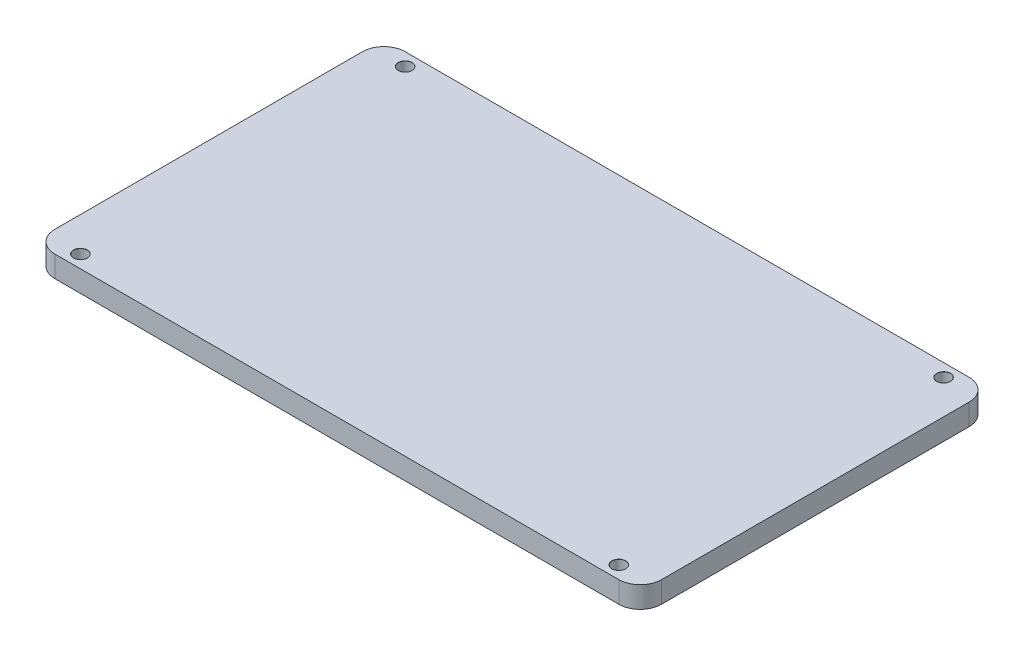
ISO-10303-21;
HEADER;
FILE_DESCRIPTION(('STEP AP214'),'2;1');
FILE_NAME('part.step','',(''),(''),'','','');
FILE_SCHEMA(('AUTOMOTIVE_DESIGN { 1 0 10303 214 1 1 1 1 }'));
ENDSEC;
DATA;
#1=APPLICATION_CONTEXT('core data for automotive mechanical design processes');
#2=APPLICATION_PROTOCOL_DEFINITION('international standard','automotive_design',2000,#1);
#3=PRODUCT_CONTEXT('',#1,'mechanical');
#4=PRODUCT('Part','Part','',(#3));
#5=PRODUCT_RELATED_PRODUCT_CATEGORY('part','',(#4));
#6=PRODUCT_DEFINITION_FORMATION('','',#4);
#7=PRODUCT_DEFINITION_CONTEXT('part definition',#1,'design');
#8=PRODUCT_DEFINITION('design','',#6,#7);
#9=PRODUCT_DEFINITION_SHAPE('','',#8);
#10=(LENGTH_UNIT() NAMED_UNIT(*) SI_UNIT(.MILLI.,.METRE.));
#11=(NAMED_UNIT(*) PLANE_ANGLE_UNIT() SI_UNIT($,.RADIAN.));
#12=(NAMED_UNIT(*) SI_UNIT($,.STERADIAN.) SOLID_ANGLE_UNIT());
#13=UNCERTAINTY_MEASURE_WITH_UNIT(LENGTH_MEASURE(1.E-05),#10,'distance_accuracy_value','');
#14=(GEOMETRIC_REPRESENTATION_CONTEXT(3) GLOBAL_UNCERTAINTY_ASSIGNED_CONTEXT((#13)) GLOBAL_UNIT_ASSIGNED_CONTEXT((#10,
#11,#12)) REPRESENTATION_CONTEXT('',''));
#15=CARTESIAN_POINT('',(0.,0.,0.));
#16=DIRECTION('',(0.,0.,1.));
#17=DIRECTION('',(1.,0.,0.));
#18=AXIS2_PLACEMENT_3D('',#15,#16,#17);
#19=CARTESIAN_POINT('',(71.,5.,41.));
#20=DIRECTION('',(-1.,0.,0.));
#21=DIRECTION('',(0.,0.,1.));
#22=AXIS2_PLACEMENT_3D('',#19,#20,#21);
#23=PLANE('',#22);
#24=DIRECTION('',(0.,0.,-1.));
#25=VECTOR('',#24,1.);
#26=CARTESIAN_POINT('',(71.,0.,41.));
#27=LINE('',#26,#25);
#28=CARTESIAN_POINT('',(71.,0.,36.));
#29=VERTEX_POINT('',#28);
#30=CARTESIAN_POINT('',(71.,0.,-36.));
#31=VERTEX_POINT('',#30);
#32=EDGE_CURVE('E136',#29,#31,#27,.T.);
#33=ORIENTED_EDGE('',*,*,#32,.T.);
#34=DIRECTION('',(0.,-1.,0.));
#35=VECTOR('',#34,1.);
#36=CARTESIAN_POINT('',(71.,5.,-36.));
#37=LINE('',#36,#35);
#38=CARTESIAN_POINT('',(71.,5.,-36.));
#39=VERTEX_POINT('',#38);
#40=EDGE_CURVE('E111',#31,#39,#37,.F.);
#41=ORIENTED_EDGE('',*,*,#40,.T.);
#42=DIRECTION('',(0.,0.,-1.));
#43=VECTOR('',#42,1.);
#44=CARTESIAN_POINT('',(71.,5.,41.));
#45=LINE('',#44,#43);
#46=CARTESIAN_POINT('',(71.,5.,36.));
#47=VERTEX_POINT('',#46);
#48=EDGE_CURVE('E149',#47,#39,#45,.T.);
#49=ORIENTED_EDGE('',*,*,#48,.F.);
#50=DIRECTION('',(0.,-1.,0.));
#51=VECTOR('',#50,1.);
#52=CARTESIAN_POINT('',(71.,5.,36.));
#53=LINE('',#52,#51);
#54=EDGE_CURVE('E117',#47,#29,#53,.T.);
#55=ORIENTED_EDGE('',*,*,#54,.T.);
#56=EDGE_LOOP('',(#33,#41,#49,#55));
#57=FACE_BOUND('',#56,.T.);
#58=ADVANCED_FACE('F39',(#57),#23,.F.);
#59=CARTESIAN_POINT('',(-71.,5.,-41.));
#60=DIRECTION('',(0.,0.,1.));
#61=DIRECTION('',(1.,0.,0.));
#62=AXIS2_PLACEMENT_3D('',#59,#60,#61);
#63=PLANE('',#62);
#64=DIRECTION('',(-1.,0.,0.));
#65=VECTOR('',#64,1.);
#66=CARTESIAN_POINT('',(-71.,5.,-41.));
#67=LINE('',#66,#65);
#68=CARTESIAN_POINT('',(66.,5.,-41.));
#69=VERTEX_POINT('',#68);
#70=CARTESIAN_POINT('',(-66.,5.,-41.));
#71=VERTEX_POINT('',#70);
#72=EDGE_CURVE('E127',#69,#71,#67,.T.);
#73=ORIENTED_EDGE('',*,*,#72,.F.);
#74=DIRECTION('',(0.,-1.,0.));
#75=VECTOR('',#74,1.);
#76=CARTESIAN_POINT('',(66.,5.,-41.));
#77=LINE('',#76,#75);
#78=CARTESIAN_POINT('',(66.,0.,-41.));
#79=VERTEX_POINT('',#78);
#80=EDGE_CURVE('E110',#69,#79,#77,.T.);
#81=ORIENTED_EDGE('',*,*,#80,.T.);
#82=DIRECTION('',(-1.,0.,0.));
#83=VECTOR('',#82,1.);
#84=CARTESIAN_POINT('',(-71.,0.,-41.));
#85=LINE('',#84,#83);
#86=CARTESIAN_POINT('',(-66.,0.,-41.));
#87=VERTEX_POINT('',#86);
#88=EDGE_CURVE('E124',#79,#87,#85,.T.);
#89=ORIENTED_EDGE('',*,*,#88,.T.);
#90=DIRECTION('',(0.,-1.,0.));
#91=VECTOR('',#90,1.);
#92=CARTESIAN_POINT('',(-66.,5.,-41.));
#93=LINE('',#92,#91);
#94=EDGE_CURVE('E130',#87,#71,#93,.F.);
#95=ORIENTED_EDGE('',*,*,#94,.T.);
#96=EDGE_LOOP('',(#73,#81,#89,#95));
#97=FACE_BOUND('',#96,.T.);
#98=ADVANCED_FACE('F123',(#97),#63,.F.);
#99=CARTESIAN_POINT('',(-71.,5.,41.));
#100=DIRECTION('',(1.,0.,0.));
#101=DIRECTION('',(0.,0.,-1.));
#102=AXIS2_PLACEMENT_3D('',#99,#100,#101);
#103=PLANE('',#102);
#104=DIRECTION('',(0.,0.,1.));
#105=VECTOR('',#104,1.);
#106=CARTESIAN_POINT('',(-71.,0.,41.));
#107=LINE('',#106,#105);
#108=CARTESIAN_POINT('',(-71.,0.,-36.));
#109=VERTEX_POINT('',#108);
#110=CARTESIAN_POINT('',(-71.,0.,36.));
#111=VERTEX_POINT('',#110);
#112=EDGE_CURVE('E135',#109,#111,#107,.T.);
#113=ORIENTED_EDGE('',*,*,#112,.T.);
#114=DIRECTION('',(0.,-1.,0.));
#115=VECTOR('',#114,1.);
#116=CARTESIAN_POINT('',(-71.,5.,36.));
#117=LINE('',#116,#115);
#118=CARTESIAN_POINT('',(-71.,5.,36.));
#119=VERTEX_POINT('',#118);
#120=EDGE_CURVE('E11',#111,#119,#117,.F.);
#121=ORIENTED_EDGE('',*,*,#120,.T.);
#122=DIRECTION('',(0.,0.,1.));
#123=VECTOR('',#122,1.);
#124=CARTESIAN_POINT('',(-71.,5.,41.));
#125=LINE('',#124,#123);
#126=CARTESIAN_POINT('',(-71.,5.,-36.));
#127=VERTEX_POINT('',#126);
#128=EDGE_CURVE('E188',#127,#119,#125,.T.);
#129=ORIENTED_EDGE('',*,*,#128,.F.);
#130=DIRECTION('',(0.,-1.,0.));
#131=VECTOR('',#130,1.);
#132=CARTESIAN_POINT('',(-71.,5.,-36.));
#133=LINE('',#132,#131);
#134=EDGE_CURVE('E48',#127,#109,#133,.T.);
#135=ORIENTED_EDGE('',*,*,#134,.T.);
#136=EDGE_LOOP('',(#113,#121,#129,#135));
#137=FACE_BOUND('',#136,.T.);
#138=ADVANCED_FACE('F186',(#137),#103,.F.);
#139=CARTESIAN_POINT('',(-71.,5.,41.));
#140=DIRECTION('',(0.,0.,-1.));
#141=DIRECTION('',(-1.,0.,0.));
#142=AXIS2_PLACEMENT_3D('',#139,#140,#141);
#143=PLANE('',#142);
#144=DIRECTION('',(1.,0.,0.));
#145=VECTOR('',#144,1.);
#146=CARTESIAN_POINT('',(-71.,0.,41.));
#147=LINE('',#146,#145);
#148=CARTESIAN_POINT('',(-66.,0.,41.));
#149=VERTEX_POINT('',#148);
#150=CARTESIAN_POINT('',(66.,0.,41.));
#151=VERTEX_POINT('',#150);
#152=EDGE_CURVE('E141',#149,#151,#147,.T.);
#153=ORIENTED_EDGE('',*,*,#152,.T.);
#154=DIRECTION('',(0.,-1.,0.));
#155=VECTOR('',#154,1.);
#156=CARTESIAN_POINT('',(66.,5.,41.));
#157=LINE('',#156,#155);
#158=CARTESIAN_POINT('',(66.,5.,41.));
#159=VERTEX_POINT('',#158);
#160=EDGE_CURVE('E55',#151,#159,#157,.F.);
#161=ORIENTED_EDGE('',*,*,#160,.T.);
#162=DIRECTION('',(1.,0.,0.));
#163=VECTOR('',#162,1.);
#164=CARTESIAN_POINT('',(-71.,5.,41.));
#165=LINE('',#164,#163);
#166=CARTESIAN_POINT('',(-66.,5.,41.));
#167=VERTEX_POINT('',#166);
#168=EDGE_CURVE('E151',#167,#159,#165,.T.);
#169=ORIENTED_EDGE('',*,*,#168,.F.);
#170=DIRECTION('',(0.,-1.,0.));
#171=VECTOR('',#170,1.);
#172=CARTESIAN_POINT('',(-66.,5.,41.));
#173=LINE('',#172,#171);
#174=EDGE_CURVE('E176',#167,#149,#173,.T.);
#175=ORIENTED_EDGE('',*,*,#174,.T.);
#176=EDGE_LOOP('',(#153,#161,#169,#175));
#177=FACE_BOUND('',#176,.T.);
#178=ADVANCED_FACE('F195',(#177),#143,.F.);
#179=CARTESIAN_POINT('',(0.,5.,0.));
#180=DIRECTION('',(0.,-1.,0.));
#181=DIRECTION('',(0.,0.,-1.));
#182=AXIS2_PLACEMENT_3D('',#179,#180,#181);
#183=PLANE('',#182);
#184=CARTESIAN_POINT('',(-63.,5.,-38.));
#185=DIRECTION('',(0.,1.,0.));
#186=DIRECTION('',(0.,0.,1.));
#187=AXIS2_PLACEMENT_3D('',#184,#185,#186);
#188=CIRCLE('',#187,1.625);
#189=CARTESIAN_POINT('',(-63.,5.,-36.375));
#190=VERTEX_POINT('',#189);
#191=EDGE_CURVE('E249',#190,#190,#188,.T.);
#192=ORIENTED_EDGE('',*,*,#191,.F.);
#193=EDGE_LOOP('',(#192));
#194=FACE_BOUND('',#193,.T.);
#195=CARTESIAN_POINT('',(-63.,5.,38.));
#196=DIRECTION('',(0.,1.,0.));
#197=DIRECTION('',(0.,0.,1.));
#198=AXIS2_PLACEMENT_3D('',#195,#196,#197);
#199=CIRCLE('',#198,1.625);
#200=CARTESIAN_POINT('',(-63.,5.,39.625));
#201=VERTEX_POINT('',#200);
#202=EDGE_CURVE('E237',#201,#201,#199,.T.);
#203=ORIENTED_EDGE('',*,*,#202,.F.);
#204=EDGE_LOOP('',(#203));
#205=FACE_BOUND('',#204,.T.);
#206=CARTESIAN_POINT('',(63.,5.,-38.));
#207=DIRECTION('',(0.,1.,0.));
#208=DIRECTION('',(0.,0.,1.));
#209=AXIS2_PLACEMENT_3D('',#206,#207,#208);
#210=CIRCLE('',#209,1.625);
#211=CARTESIAN_POINT('',(63.,5.,-36.375));
#212=VERTEX_POINT('',#211);
#213=EDGE_CURVE('E225',#212,#212,#210,.T.);
#214=ORIENTED_EDGE('',*,*,#213,.F.);
#215=EDGE_LOOP('',(#214));
#216=FACE_BOUND('',#215,.T.);
#217=CARTESIAN_POINT('',(63.,5.,38.));
#218=DIRECTION('',(0.,1.,0.));
#219=DIRECTION('',(0.,0.,1.));
#220=AXIS2_PLACEMENT_3D('',#217,#218,#219);
#221=CIRCLE('',#220,1.625);
#222=CARTESIAN_POINT('',(63.,5.,39.625));
#223=VERTEX_POINT('',#222);
#224=EDGE_CURVE('E213',#223,#223,#221,.T.);
#225=ORIENTED_EDGE('',*,*,#224,.F.);
#226=EDGE_LOOP('',(#225));
#227=FACE_BOUND('',#226,.T.);
#228=ORIENTED_EDGE('',*,*,#48,.T.);
#229=CARTESIAN_POINT('',(66.,5.,-36.));
#230=DIRECTION('',(0.,-1.,0.));
#231=DIRECTION('',(0.,0.,-1.));
#232=AXIS2_PLACEMENT_3D('',#229,#230,#231);
#233=CIRCLE('',#232,5.);
#234=EDGE_CURVE('E173',#39,#69,#233,.F.);
#235=ORIENTED_EDGE('',*,*,#234,.T.);
#236=ORIENTED_EDGE('',*,*,#72,.T.);
#237=CARTESIAN_POINT('',(-66.,5.,-36.));
#238=DIRECTION('',(0.,-1.,0.));
#239=DIRECTION('',(0.,0.,-1.));
#240=AXIS2_PLACEMENT_3D('',#237,#238,#239);
#241=CIRCLE('',#240,5.);
#242=EDGE_CURVE('E165',#71,#127,#241,.F.);
#243=ORIENTED_EDGE('',*,*,#242,.T.);
#244=ORIENTED_EDGE('',*,*,#128,.T.);
#245=CARTESIAN_POINT('',(-66.,5.,36.));
#246=DIRECTION('',(0.,-1.,0.));
#247=DIRECTION('',(0.,0.,-1.));
#248=AXIS2_PLACEMENT_3D('',#245,#246,#247);
#249=CIRCLE('',#248,5.);
#250=EDGE_CURVE('E62',#119,#167,#249,.F.);
#251=ORIENTED_EDGE('',*,*,#250,.T.);
#252=ORIENTED_EDGE('',*,*,#168,.T.);
#253=CARTESIAN_POINT('',(66.,5.,36.));
#254=DIRECTION('',(0.,-1.,0.));
#255=DIRECTION('',(0.,0.,-1.));
#256=AXIS2_PLACEMENT_3D('',#253,#254,#255);
#257=CIRCLE('',#256,5.);
#258=EDGE_CURVE('E170',#159,#47,#257,.F.);
#259=ORIENTED_EDGE('',*,*,#258,.T.);
#260=EDGE_LOOP('',(#228,#235,#236,#243,#244,#251,#252,#259));
#261=FACE_BOUND('',#260,.T.);
#262=ADVANCED_FACE('F256',(#194,#205,#216,#227,#261),#183,.F.);
#263=CARTESIAN_POINT('',(0.,0.,0.));
#264=DIRECTION('',(0.,-1.,0.));
#265=DIRECTION('',(0.,0.,-1.));
#266=AXIS2_PLACEMENT_3D('',#263,#264,#265);
#267=PLANE('',#266);
#268=CARTESIAN_POINT('',(-63.,0.,-38.));
#269=DIRECTION('',(0.,1.,0.));
#270=DIRECTION('',(0.,0.,1.));
#271=AXIS2_PLACEMENT_3D('',#268,#269,#270);
#272=CIRCLE('',#271,1.6);
#273=CARTESIAN_POINT('',(-63.,0.,-36.4));
#274=VERTEX_POINT('',#273);
#275=EDGE_CURVE('E241',#274,#274,#272,.T.);
#276=ORIENTED_EDGE('',*,*,#275,.T.);
#277=EDGE_LOOP('',(#276));
#278=FACE_BOUND('',#277,.T.);
#279=CARTESIAN_POINT('',(-63.,0.,38.));
#280=DIRECTION('',(0.,1.,0.));
#281=DIRECTION('',(0.,0.,1.));
#282=AXIS2_PLACEMENT_3D('',#279,#280,#281);
#283=CIRCLE('',#282,1.6);
#284=CARTESIAN_POINT('',(-63.,0.,39.6));
#285=VERTEX_POINT('',#284);
#286=EDGE_CURVE('E229',#285,#285,#283,.T.);
#287=ORIENTED_EDGE('',*,*,#286,.T.);
#288=EDGE_LOOP('',(#287));
#289=FACE_BOUND('',#288,.T.);
#290=CARTESIAN_POINT('',(63.,0.,-38.));
#291=DIRECTION('',(0.,1.,0.));
#292=DIRECTION('',(0.,0.,1.));
#293=AXIS2_PLACEMENT_3D('',#290,#291,#292);
#294=CIRCLE('',#293,1.6);
#295=CARTESIAN_POINT('',(63.,0.,-36.4));
#296=VERTEX_POINT('',#295);
#297=EDGE_CURVE('E217',#296,#296,#294,.T.);
#298=ORIENTED_EDGE('',*,*,#297,.T.);
#299=EDGE_LOOP('',(#298));
#300=FACE_BOUND('',#299,.T.);
#301=CARTESIAN_POINT('',(63.,0.,38.));
#302=DIRECTION('',(0.,1.,0.));
#303=DIRECTION('',(0.,0.,1.));
#304=AXIS2_PLACEMENT_3D('',#301,#302,#303);
#305=CIRCLE('',#304,1.6);
#306=CARTESIAN_POINT('',(63.,0.,39.6));
#307=VERTEX_POINT('',#306);
#308=EDGE_CURVE('E143',#307,#307,#305,.T.);
#309=ORIENTED_EDGE('',*,*,#308,.T.);
#310=EDGE_LOOP('',(#309));
#311=FACE_BOUND('',#310,.T.);
#312=ORIENTED_EDGE('',*,*,#88,.F.);
#313=CARTESIAN_POINT('',(66.,0.,-36.));
#314=DIRECTION('',(0.,-1.,0.));
#315=DIRECTION('',(0.,0.,-1.));
#316=AXIS2_PLACEMENT_3D('',#313,#314,#315);
#317=CIRCLE('',#316,5.);
#318=EDGE_CURVE('E106',#79,#31,#317,.T.);
#319=ORIENTED_EDGE('',*,*,#318,.T.);
#320=ORIENTED_EDGE('',*,*,#32,.F.);
#321=CARTESIAN_POINT('',(66.,0.,36.));
#322=DIRECTION('',(0.,-1.,0.));
#323=DIRECTION('',(0.,0.,-1.));
#324=AXIS2_PLACEMENT_3D('',#321,#322,#323);
#325=CIRCLE('',#324,5.);
#326=EDGE_CURVE('E118',#29,#151,#325,.T.);
#327=ORIENTED_EDGE('',*,*,#326,.T.);
#328=ORIENTED_EDGE('',*,*,#152,.F.);
#329=CARTESIAN_POINT('',(-66.,0.,36.));
#330=DIRECTION('',(0.,-1.,0.));
#331=DIRECTION('',(0.,0.,-1.));
#332=AXIS2_PLACEMENT_3D('',#329,#330,#331);
#333=CIRCLE('',#332,5.);
#334=EDGE_CURVE('E155',#149,#111,#333,.T.);
#335=ORIENTED_EDGE('',*,*,#334,.T.);
#336=ORIENTED_EDGE('',*,*,#112,.F.);
#337=CARTESIAN_POINT('',(-66.,0.,-36.));
#338=DIRECTION('',(0.,-1.,0.));
#339=DIRECTION('',(0.,0.,-1.));
#340=AXIS2_PLACEMENT_3D('',#337,#338,#339);
#341=CIRCLE('',#340,5.);
#342=EDGE_CURVE('E129',#109,#87,#341,.T.);
#343=ORIENTED_EDGE('',*,*,#342,.T.);
#344=EDGE_LOOP('',(#312,#319,#320,#327,#328,#335,#336,#343));
#345=FACE_BOUND('',#344,.T.);
#346=ADVANCED_FACE('F132',(#278,#289,#300,#311,#345),#267,.T.);
#347=CARTESIAN_POINT('',(63.,5.,38.));
#348=DIRECTION('',(0.,1.,0.));
#349=DIRECTION('',(0.,0.,1.));
#350=AXIS2_PLACEMENT_3D('',#347,#348,#349);
#351=CYLINDRICAL_SURFACE('',#350,1.6);
#352=ORIENTED_EDGE('',*,*,#308,.F.);
#353=EDGE_LOOP('',(#352));
#354=FACE_BOUND('',#353,.T.);
#355=CARTESIAN_POINT('',(63.,4.97500000000002,38.));
#356=DIRECTION('',(0.,1.,0.));
#357=DIRECTION('',(0.,0.,1.));
#358=AXIS2_PLACEMENT_3D('',#355,#356,#357);
#359=CIRCLE('',#358,1.59999999999999);
#360=CARTESIAN_POINT('',(63.,4.97500000000002,39.6));
#361=VERTEX_POINT('',#360);
#362=EDGE_CURVE('E209',#361,#361,#359,.T.);
#363=ORIENTED_EDGE('',*,*,#362,.T.);
#364=EDGE_LOOP('',(#363));
#365=FACE_BOUND('',#364,.T.);
#366=ADVANCED_FACE('F289',(#354,#365),#351,.F.);
#367=CARTESIAN_POINT('',(63.,5.,38.));
#368=DIRECTION('',(0.,1.,0.));
#369=DIRECTION('',(0.,0.,1.));
#370=AXIS2_PLACEMENT_3D('',#367,#368,#369);
#371=CONICAL_SURFACE('',#370,1.625,0.785398163397969);
#372=ORIENTED_EDGE('',*,*,#362,.F.);
#373=EDGE_LOOP('',(#372));
#374=FACE_BOUND('',#373,.T.);
#375=ORIENTED_EDGE('',*,*,#224,.T.);
#376=EDGE_LOOP('',(#375));
#377=FACE_BOUND('',#376,.T.);
#378=ADVANCED_FACE('F294',(#374,#377),#371,.F.);
#379=CARTESIAN_POINT('',(63.,5.,-38.));
#380=DIRECTION('',(0.,1.,0.));
#381=DIRECTION('',(0.,0.,1.));
#382=AXIS2_PLACEMENT_3D('',#379,#380,#381);
#383=CYLINDRICAL_SURFACE('',#382,1.6);
#384=ORIENTED_EDGE('',*,*,#297,.F.);
#385=EDGE_LOOP('',(#384));
#386=FACE_BOUND('',#385,.T.);
#387=CARTESIAN_POINT('',(63.,4.97500000000002,-38.));
#388=DIRECTION('',(0.,1.,0.));
#389=DIRECTION('',(0.,0.,1.));
#390=AXIS2_PLACEMENT_3D('',#387,#388,#389);
#391=CIRCLE('',#390,1.59999999999999);
#392=CARTESIAN_POINT('',(63.,4.97500000000002,-36.4));
#393=VERTEX_POINT('',#392);
#394=EDGE_CURVE('E221',#393,#393,#391,.T.);
#395=ORIENTED_EDGE('',*,*,#394,.T.);
#396=EDGE_LOOP('',(#395));
#397=FACE_BOUND('',#396,.T.);
#398=ADVANCED_FACE('F298',(#386,#397),#383,.F.);
#399=CARTESIAN_POINT('',(63.,5.,-38.));
#400=DIRECTION('',(0.,1.,0.));
#401=DIRECTION('',(0.,0.,1.));
#402=AXIS2_PLACEMENT_3D('',#399,#400,#401);
#403=CONICAL_SURFACE('',#402,1.625,0.785398163397969);
#404=ORIENTED_EDGE('',*,*,#394,.F.);
#405=EDGE_LOOP('',(#404));
#406=FACE_BOUND('',#405,.T.);
#407=ORIENTED_EDGE('',*,*,#213,.T.);
#408=EDGE_LOOP('',(#407));
#409=FACE_BOUND('',#408,.T.);
#410=ADVANCED_FACE('F302',(#406,#409),#403,.F.);
#411=CARTESIAN_POINT('',(-63.,5.,38.));
#412=DIRECTION('',(0.,1.,0.));
#413=DIRECTION('',(0.,0.,1.));
#414=AXIS2_PLACEMENT_3D('',#411,#412,#413);
#415=CYLINDRICAL_SURFACE('',#414,1.59999999999999);
#416=ORIENTED_EDGE('',*,*,#286,.F.);
#417=EDGE_LOOP('',(#416));
#418=FACE_BOUND('',#417,.T.);
#419=CARTESIAN_POINT('',(-63.,4.97500000000002,38.));
#420=DIRECTION('',(0.,1.,0.));
#421=DIRECTION('',(0.,0.,1.));
#422=AXIS2_PLACEMENT_3D('',#419,#420,#421);
#423=CIRCLE('',#422,1.59999999999999);
#424=CARTESIAN_POINT('',(-63.,4.97500000000002,39.6));
#425=VERTEX_POINT('',#424);
#426=EDGE_CURVE('E233',#425,#425,#423,.T.);
#427=ORIENTED_EDGE('',*,*,#426,.T.);
#428=EDGE_LOOP('',(#427));
#429=FACE_BOUND('',#428,.T.);
#430=ADVANCED_FACE('F306',(#418,#429),#415,.F.);
#431=CARTESIAN_POINT('',(-63.,5.,38.));
#432=DIRECTION('',(0.,1.,0.));
#433=DIRECTION('',(0.,0.,1.));
#434=AXIS2_PLACEMENT_3D('',#431,#432,#433);
#435=CONICAL_SURFACE('',#434,1.625,0.785398163397969);
#436=ORIENTED_EDGE('',*,*,#426,.F.);
#437=EDGE_LOOP('',(#436));
#438=FACE_BOUND('',#437,.T.);
#439=ORIENTED_EDGE('',*,*,#202,.T.);
#440=EDGE_LOOP('',(#439));
#441=FACE_BOUND('',#440,.T.);
#442=ADVANCED_FACE('F310',(#438,#441),#435,.F.);
#443=CARTESIAN_POINT('',(-63.,5.,-38.));
#444=DIRECTION('',(0.,1.,0.));
#445=DIRECTION('',(0.,0.,1.));
#446=AXIS2_PLACEMENT_3D('',#443,#444,#445);
#447=CYLINDRICAL_SURFACE('',#446,1.59999999999999);
#448=ORIENTED_EDGE('',*,*,#275,.F.);
#449=EDGE_LOOP('',(#448));
#450=FACE_BOUND('',#449,.T.);
#451=CARTESIAN_POINT('',(-63.,4.97500000000002,-38.));
#452=DIRECTION('',(0.,1.,0.));
#453=DIRECTION('',(0.,0.,1.));
#454=AXIS2_PLACEMENT_3D('',#451,#452,#453);
#455=CIRCLE('',#454,1.59999999999999);
#456=CARTESIAN_POINT('',(-63.,4.97500000000002,-36.4));
#457=VERTEX_POINT('',#456);
#458=EDGE_CURVE('E245',#457,#457,#455,.T.);
#459=ORIENTED_EDGE('',*,*,#458,.T.);
#460=EDGE_LOOP('',(#459));
#461=FACE_BOUND('',#460,.T.);
#462=ADVANCED_FACE('F314',(#450,#461),#447,.F.);
#463=CARTESIAN_POINT('',(-63.,5.,-38.));
#464=DIRECTION('',(0.,1.,0.));
#465=DIRECTION('',(0.,0.,1.));
#466=AXIS2_PLACEMENT_3D('',#463,#464,#465);
#467=CONICAL_SURFACE('',#466,1.625,0.785398163397969);
#468=ORIENTED_EDGE('',*,*,#458,.F.);
#469=EDGE_LOOP('',(#468));
#470=FACE_BOUND('',#469,.T.);
#471=ORIENTED_EDGE('',*,*,#191,.T.);
#472=EDGE_LOOP('',(#471));
#473=FACE_BOUND('',#472,.T.);
#474=ADVANCED_FACE('F254',(#470,#473),#467,.F.);
#475=CARTESIAN_POINT('',(66.,5.,-36.));
#476=DIRECTION('',(0.,-1.,0.));
#477=DIRECTION('',(0.,0.,-1.));
#478=AXIS2_PLACEMENT_3D('',#475,#476,#477);
#479=CYLINDRICAL_SURFACE('',#478,5.);
#480=ORIENTED_EDGE('',*,*,#234,.F.);
#481=ORIENTED_EDGE('',*,*,#40,.F.);
#482=ORIENTED_EDGE('',*,*,#318,.F.);
#483=ORIENTED_EDGE('',*,*,#80,.F.);
#484=EDGE_LOOP('',(#480,#481,#482,#483));
#485=FACE_BOUND('',#484,.T.);
#486=ADVANCED_FACE('F109',(#485),#479,.T.);
#487=CARTESIAN_POINT('',(66.,5.,36.));
#488=DIRECTION('',(0.,-1.,0.));
#489=DIRECTION('',(0.,0.,-1.));
#490=AXIS2_PLACEMENT_3D('',#487,#488,#489);
#491=CYLINDRICAL_SURFACE('',#490,5.);
#492=ORIENTED_EDGE('',*,*,#258,.F.);
#493=ORIENTED_EDGE('',*,*,#160,.F.);
#494=ORIENTED_EDGE('',*,*,#326,.F.);
#495=ORIENTED_EDGE('',*,*,#54,.F.);
#496=EDGE_LOOP('',(#492,#493,#494,#495));
#497=FACE_BOUND('',#496,.T.);
#498=ADVANCED_FACE('F269',(#497),#491,.T.);
#499=CARTESIAN_POINT('',(-66.,5.,36.));
#500=DIRECTION('',(0.,-1.,0.));
#501=DIRECTION('',(0.,0.,-1.));
#502=AXIS2_PLACEMENT_3D('',#499,#500,#501);
#503=CYLINDRICAL_SURFACE('',#502,5.);
#504=ORIENTED_EDGE('',*,*,#250,.F.);
#505=ORIENTED_EDGE('',*,*,#120,.F.);
#506=ORIENTED_EDGE('',*,*,#334,.F.);
#507=ORIENTED_EDGE('',*,*,#174,.F.);
#508=EDGE_LOOP('',(#504,#505,#506,#507));
#509=FACE_BOUND('',#508,.T.);
#510=ADVANCED_FACE('F194',(#509),#503,.T.);
#511=CARTESIAN_POINT('',(-66.,5.,-36.));
#512=DIRECTION('',(0.,-1.,0.));
#513=DIRECTION('',(0.,0.,-1.));
#514=AXIS2_PLACEMENT_3D('',#511,#512,#513);
#515=CYLINDRICAL_SURFACE('',#514,5.);
#516=ORIENTED_EDGE('',*,*,#242,.F.);
#517=ORIENTED_EDGE('',*,*,#94,.F.);
#518=ORIENTED_EDGE('',*,*,#342,.F.);
#519=ORIENTED_EDGE('',*,*,#134,.F.);
#520=EDGE_LOOP('',(#516,#517,#518,#519));
#521=FACE_BOUND('',#520,.T.);
#522=ADVANCED_FACE('F41',(#521),#515,.T.);
#523=CLOSED_SHELL('',(#58,#98,#138,#178,#262,#346,#366,#378,#398,#410,#430,#442,#462,#474,#486,
#498,#510,#522));
#524=MANIFOLD_SOLID_BREP('B2',#523);
#525=ADVANCED_BREP_SHAPE_REPRESENTATION('',(#18,#524),#14);
#526=SHAPE_DEFINITION_REPRESENTATION(#9,#525);
ENDSEC;
END-ISO-10303-21;
